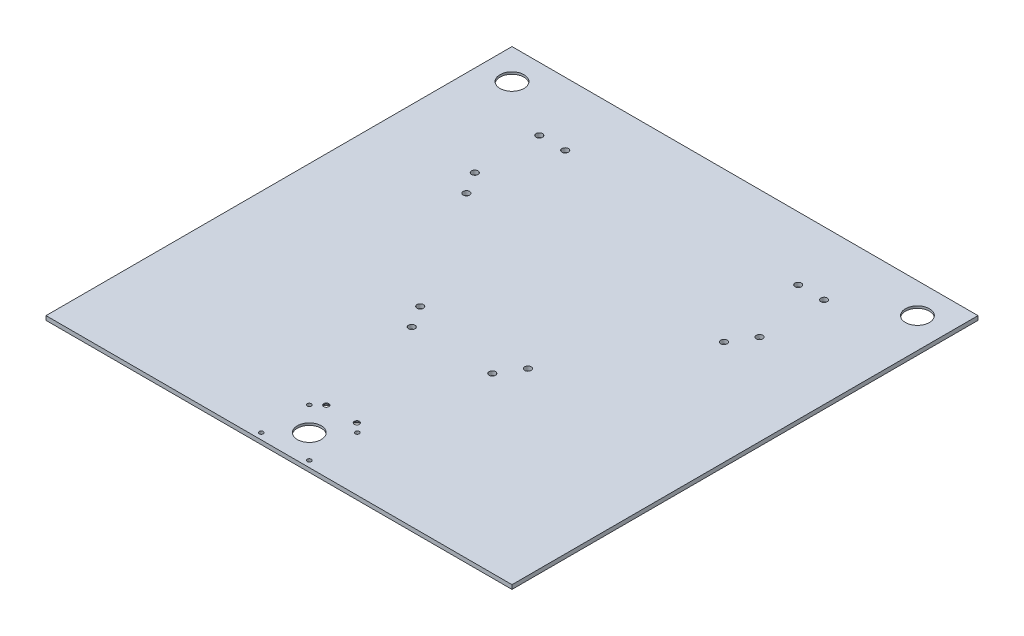
ISO-10303-21;
HEADER;
FILE_DESCRIPTION(('STEP AP214'),'2;1');
FILE_NAME('part.step','',(''),(''),'','','');
FILE_SCHEMA(('AUTOMOTIVE_DESIGN { 1 0 10303 214 1 1 1 1 }'));
ENDSEC;
DATA;
#1=APPLICATION_CONTEXT('core data for automotive mechanical design processes');
#2=APPLICATION_PROTOCOL_DEFINITION('international standard','automotive_design',2000,#1);
#3=PRODUCT_CONTEXT('',#1,'mechanical');
#4=PRODUCT('Part','Part','',(#3));
#5=PRODUCT_RELATED_PRODUCT_CATEGORY('part','',(#4));
#6=PRODUCT_DEFINITION_FORMATION('','',#4);
#7=PRODUCT_DEFINITION_CONTEXT('part definition',#1,'design');
#8=PRODUCT_DEFINITION('design','',#6,#7);
#9=PRODUCT_DEFINITION_SHAPE('','',#8);
#10=(LENGTH_UNIT() NAMED_UNIT(*) SI_UNIT(.MILLI.,.METRE.));
#11=(NAMED_UNIT(*) PLANE_ANGLE_UNIT() SI_UNIT($,.RADIAN.));
#12=(NAMED_UNIT(*) SI_UNIT($,.STERADIAN.) SOLID_ANGLE_UNIT());
#13=UNCERTAINTY_MEASURE_WITH_UNIT(LENGTH_MEASURE(1.E-05),#10,'distance_accuracy_value','');
#14=(GEOMETRIC_REPRESENTATION_CONTEXT(3) GLOBAL_UNCERTAINTY_ASSIGNED_CONTEXT((#13)) GLOBAL_UNIT_ASSIGNED_CONTEXT((#10,
#11,#12)) REPRESENTATION_CONTEXT('',''));
#15=CARTESIAN_POINT('',(0.,0.,0.));
#16=DIRECTION('',(0.,0.,1.));
#17=DIRECTION('',(1.,0.,0.));
#18=AXIS2_PLACEMENT_3D('',#15,#16,#17);
#19=CARTESIAN_POINT('',(228.6,4.064,228.6));
#20=DIRECTION('',(-1.,0.,0.));
#21=DIRECTION('',(0.,0.,1.));
#22=AXIS2_PLACEMENT_3D('',#19,#20,#21);
#23=PLANE('',#22);
#24=DIRECTION('',(0.,0.,-1.));
#25=VECTOR('',#24,1.);
#26=CARTESIAN_POINT('',(228.6,0.,228.6));
#27=LINE('',#26,#25);
#28=CARTESIAN_POINT('',(228.6,0.,228.6));
#29=VERTEX_POINT('',#28);
#30=CARTESIAN_POINT('',(228.6,0.,-228.6));
#31=VERTEX_POINT('',#30);
#32=EDGE_CURVE('E97',#29,#31,#27,.T.);
#33=ORIENTED_EDGE('',*,*,#32,.T.);
#34=DIRECTION('',(0.,-1.,0.));
#35=VECTOR('',#34,1.);
#36=CARTESIAN_POINT('',(228.6,4.064,-228.6));
#37=LINE('',#36,#35);
#38=CARTESIAN_POINT('',(228.6,4.064,-228.6));
#39=VERTEX_POINT('',#38);
#40=EDGE_CURVE('E11',#39,#31,#37,.T.);
#41=ORIENTED_EDGE('',*,*,#40,.F.);
#42=DIRECTION('',(0.,0.,-1.));
#43=VECTOR('',#42,1.);
#44=CARTESIAN_POINT('',(228.6,4.064,228.6));
#45=LINE('',#44,#43);
#46=CARTESIAN_POINT('',(228.6,4.064,228.6));
#47=VERTEX_POINT('',#46);
#48=EDGE_CURVE('E85',#47,#39,#45,.T.);
#49=ORIENTED_EDGE('',*,*,#48,.F.);
#50=DIRECTION('',(0.,-1.,0.));
#51=VECTOR('',#50,1.);
#52=CARTESIAN_POINT('',(228.6,4.064,228.6));
#53=LINE('',#52,#51);
#54=EDGE_CURVE('E93',#47,#29,#53,.T.);
#55=ORIENTED_EDGE('',*,*,#54,.T.);
#56=EDGE_LOOP('',(#33,#41,#49,#55));
#57=FACE_BOUND('',#56,.T.);
#58=ADVANCED_FACE('F34',(#57),#23,.F.);
#59=CARTESIAN_POINT('',(-228.6,4.064,-228.6));
#60=DIRECTION('',(0.,0.,1.));
#61=DIRECTION('',(1.,0.,0.));
#62=AXIS2_PLACEMENT_3D('',#59,#60,#61);
#63=PLANE('',#62);
#64=DIRECTION('',(-1.,0.,0.));
#65=VECTOR('',#64,1.);
#66=CARTESIAN_POINT('',(-228.6,0.,-228.6));
#67=LINE('',#66,#65);
#68=CARTESIAN_POINT('',(-228.6,0.,-228.6));
#69=VERTEX_POINT('',#68);
#70=EDGE_CURVE('E89',#31,#69,#67,.T.);
#71=ORIENTED_EDGE('',*,*,#70,.T.);
#72=DIRECTION('',(0.,-1.,0.));
#73=VECTOR('',#72,1.);
#74=CARTESIAN_POINT('',(-228.6,4.064,-228.6));
#75=LINE('',#74,#73);
#76=CARTESIAN_POINT('',(-228.6,4.064,-228.6));
#77=VERTEX_POINT('',#76);
#78=EDGE_CURVE('E42',#77,#69,#75,.T.);
#79=ORIENTED_EDGE('',*,*,#78,.F.);
#80=DIRECTION('',(-1.,0.,0.));
#81=VECTOR('',#80,1.);
#82=CARTESIAN_POINT('',(-228.6,4.064,-228.6));
#83=LINE('',#82,#81);
#84=EDGE_CURVE('E80',#39,#77,#83,.T.);
#85=ORIENTED_EDGE('',*,*,#84,.F.);
#86=ORIENTED_EDGE('',*,*,#40,.T.);
#87=EDGE_LOOP('',(#71,#79,#85,#86));
#88=FACE_BOUND('',#87,.T.);
#89=ADVANCED_FACE('F88',(#88),#63,.F.);
#90=CARTESIAN_POINT('',(-228.6,4.064,228.6));
#91=DIRECTION('',(1.,0.,0.));
#92=DIRECTION('',(0.,0.,-1.));
#93=AXIS2_PLACEMENT_3D('',#90,#91,#92);
#94=PLANE('',#93);
#95=DIRECTION('',(0.,0.,1.));
#96=VECTOR('',#95,1.);
#97=CARTESIAN_POINT('',(-228.6,0.,228.6));
#98=LINE('',#97,#96);
#99=CARTESIAN_POINT('',(-228.6,0.,228.6));
#100=VERTEX_POINT('',#99);
#101=EDGE_CURVE('E67',#69,#100,#98,.T.);
#102=ORIENTED_EDGE('',*,*,#101,.T.);
#103=DIRECTION('',(0.,-1.,0.));
#104=VECTOR('',#103,1.);
#105=CARTESIAN_POINT('',(-228.6,4.064,228.6));
#106=LINE('',#105,#104);
#107=CARTESIAN_POINT('',(-228.6,4.064,228.6));
#108=VERTEX_POINT('',#107);
#109=EDGE_CURVE('E90',#108,#100,#106,.T.);
#110=ORIENTED_EDGE('',*,*,#109,.F.);
#111=DIRECTION('',(0.,0.,1.));
#112=VECTOR('',#111,1.);
#113=CARTESIAN_POINT('',(-228.6,4.064,228.6));
#114=LINE('',#113,#112);
#115=EDGE_CURVE('E83',#77,#108,#114,.T.);
#116=ORIENTED_EDGE('',*,*,#115,.F.);
#117=ORIENTED_EDGE('',*,*,#78,.T.);
#118=EDGE_LOOP('',(#102,#110,#116,#117));
#119=FACE_BOUND('',#118,.T.);
#120=ADVANCED_FACE('F91',(#119),#94,.F.);
#121=CARTESIAN_POINT('',(-228.6,4.064,228.6));
#122=DIRECTION('',(0.,0.,-1.));
#123=DIRECTION('',(-1.,0.,0.));
#124=AXIS2_PLACEMENT_3D('',#121,#122,#123);
#125=PLANE('',#124);
#126=DIRECTION('',(1.,0.,0.));
#127=VECTOR('',#126,1.);
#128=CARTESIAN_POINT('',(-228.6,0.,228.6));
#129=LINE('',#128,#127);
#130=EDGE_CURVE('E73',#100,#29,#129,.T.);
#131=ORIENTED_EDGE('',*,*,#130,.T.);
#132=ORIENTED_EDGE('',*,*,#54,.F.);
#133=DIRECTION('',(1.,0.,0.));
#134=VECTOR('',#133,1.);
#135=CARTESIAN_POINT('',(-228.6,4.064,228.6));
#136=LINE('',#135,#134);
#137=EDGE_CURVE('E50',#108,#47,#136,.T.);
#138=ORIENTED_EDGE('',*,*,#137,.F.);
#139=ORIENTED_EDGE('',*,*,#109,.T.);
#140=EDGE_LOOP('',(#131,#132,#138,#139));
#141=FACE_BOUND('',#140,.T.);
#142=ADVANCED_FACE('F105',(#141),#125,.F.);
#143=CARTESIAN_POINT('',(0.,4.064,0.));
#144=DIRECTION('',(0.,-1.,0.));
#145=DIRECTION('',(0.,0.,-1.));
#146=AXIS2_PLACEMENT_3D('',#143,#144,#145);
#147=PLANE('',#146);
#148=CARTESIAN_POINT('',(39.4955397352569,4.064,58.8233112326497));
#149=DIRECTION('',(0.,-1.,0.));
#150=DIRECTION('',(0.,0.,-1.));
#151=AXIS2_PLACEMENT_3D('',#148,#149,#150);
#152=CIRCLE('',#151,3.175);
#153=CARTESIAN_POINT('',(39.4955397352569,4.064,55.6483112326497));
#154=VERTEX_POINT('',#153);
#155=EDGE_CURVE('E260',#154,#154,#152,.T.);
#156=ORIENTED_EDGE('',*,*,#155,.T.);
#157=EDGE_LOOP('',(#156));
#158=FACE_BOUND('',#157,.T.);
#159=CARTESIAN_POINT('',(52.8561344372227,4.064,37.2211236302377));
#160=DIRECTION('',(0.,-1.,0.));
#161=DIRECTION('',(0.,0.,-1.));
#162=AXIS2_PLACEMENT_3D('',#159,#160,#161);
#163=CIRCLE('',#162,3.175);
#164=CARTESIAN_POINT('',(52.8561344372227,4.064,34.0461236302377));
#165=VERTEX_POINT('',#164);
#166=EDGE_CURVE('E254',#165,#165,#163,.T.);
#167=ORIENTED_EDGE('',*,*,#166,.T.);
#168=EDGE_LOOP('',(#167));
#169=FACE_BOUND('',#168,.T.);
#170=CARTESIAN_POINT('',(126.339405298034,4.064,-81.5909081830286));
#171=DIRECTION('',(0.,-1.,0.));
#172=DIRECTION('',(0.,0.,-1.));
#173=AXIS2_PLACEMENT_3D('',#170,#171,#172);
#174=CIRCLE('',#173,3.17500000000001);
#175=CARTESIAN_POINT('',(126.339405298034,4.064,-84.7659081830286));
#176=VERTEX_POINT('',#175);
#177=EDGE_CURVE('E248',#176,#176,#174,.T.);
#178=ORIENTED_EDGE('',*,*,#177,.T.);
#179=EDGE_LOOP('',(#178));
#180=FACE_BOUND('',#179,.T.);
#181=CARTESIAN_POINT('',(139.7,4.064,-103.193095785441));
#182=DIRECTION('',(0.,-1.,0.));
#183=DIRECTION('',(0.,0.,-1.));
#184=AXIS2_PLACEMENT_3D('',#181,#182,#183);
#185=CIRCLE('',#184,3.17500000000001);
#186=CARTESIAN_POINT('',(139.7,4.064,-106.368095785441));
#187=VERTEX_POINT('',#186);
#188=EDGE_CURVE('E242',#187,#187,#185,.T.);
#189=ORIENTED_EDGE('',*,*,#188,.T.);
#190=EDGE_LOOP('',(#189));
#191=FACE_BOUND('',#190,.T.);
#192=CARTESIAN_POINT('',(139.7,4.064,-166.478718596382));
#193=DIRECTION('',(0.,-1.,0.));
#194=DIRECTION('',(0.,0.,-1.));
#195=AXIS2_PLACEMENT_3D('',#192,#193,#194);
#196=CIRCLE('',#195,3.17500000000001);
#197=CARTESIAN_POINT('',(139.7,4.064,-169.653718596382));
#198=VERTEX_POINT('',#197);
#199=EDGE_CURVE('E236',#198,#198,#196,.T.);
#200=ORIENTED_EDGE('',*,*,#199,.T.);
#201=EDGE_LOOP('',(#200));
#202=FACE_BOUND('',#201,.T.);
#203=CARTESIAN_POINT('',(114.3,4.064,-166.478718596382));
#204=DIRECTION('',(0.,-1.,0.));
#205=DIRECTION('',(0.,0.,-1.));
#206=AXIS2_PLACEMENT_3D('',#203,#204,#205);
#207=CIRCLE('',#206,3.175);
#208=CARTESIAN_POINT('',(114.3,4.064,-169.653718596382));
#209=VERTEX_POINT('',#208);
#210=EDGE_CURVE('E230',#209,#209,#207,.T.);
#211=ORIENTED_EDGE('',*,*,#210,.T.);
#212=EDGE_LOOP('',(#211));
#213=FACE_BOUND('',#212,.T.);
#214=CARTESIAN_POINT('',(-114.3,4.064,-166.478718596382));
#215=DIRECTION('',(0.,-1.,0.));
#216=DIRECTION('',(0.,0.,-1.));
#217=AXIS2_PLACEMENT_3D('',#214,#215,#216);
#218=CIRCLE('',#217,3.175);
#219=CARTESIAN_POINT('',(-114.3,4.064,-169.653718596382));
#220=VERTEX_POINT('',#219);
#221=EDGE_CURVE('E224',#220,#220,#218,.T.);
#222=ORIENTED_EDGE('',*,*,#221,.T.);
#223=EDGE_LOOP('',(#222));
#224=FACE_BOUND('',#223,.T.);
#225=CARTESIAN_POINT('',(-139.7,4.064,-166.478718596382));
#226=DIRECTION('',(0.,-1.,0.));
#227=DIRECTION('',(0.,0.,-1.));
#228=AXIS2_PLACEMENT_3D('',#225,#226,#227);
#229=CIRCLE('',#228,3.17500000000001);
#230=CARTESIAN_POINT('',(-139.7,4.064,-169.653718596382));
#231=VERTEX_POINT('',#230);
#232=EDGE_CURVE('E218',#231,#231,#229,.T.);
#233=ORIENTED_EDGE('',*,*,#232,.T.);
#234=EDGE_LOOP('',(#233));
#235=FACE_BOUND('',#234,.T.);
#236=CARTESIAN_POINT('',(-139.7,4.064,-103.193095785441));
#237=DIRECTION('',(0.,-1.,0.));
#238=DIRECTION('',(0.,0.,-1.));
#239=AXIS2_PLACEMENT_3D('',#236,#237,#238);
#240=CIRCLE('',#239,3.17500000000001);
#241=CARTESIAN_POINT('',(-139.7,4.064,-106.368095785441));
#242=VERTEX_POINT('',#241);
#243=EDGE_CURVE('E212',#242,#242,#240,.T.);
#244=ORIENTED_EDGE('',*,*,#243,.T.);
#245=EDGE_LOOP('',(#244));
#246=FACE_BOUND('',#245,.T.);
#247=CARTESIAN_POINT('',(-126.339405298034,4.064,-81.5909081830286));
#248=DIRECTION('',(0.,-1.,0.));
#249=DIRECTION('',(0.,0.,-1.));
#250=AXIS2_PLACEMENT_3D('',#247,#248,#249);
#251=CIRCLE('',#250,3.175);
#252=CARTESIAN_POINT('',(-126.339405298034,4.064,-84.7659081830286));
#253=VERTEX_POINT('',#252);
#254=EDGE_CURVE('E206',#253,#253,#251,.T.);
#255=ORIENTED_EDGE('',*,*,#254,.T.);
#256=EDGE_LOOP('',(#255));
#257=FACE_BOUND('',#256,.T.);
#258=CARTESIAN_POINT('',(-52.8561344372227,4.064,37.2211236302377));
#259=DIRECTION('',(0.,-1.,0.));
#260=DIRECTION('',(0.,0.,-1.));
#261=AXIS2_PLACEMENT_3D('',#258,#259,#260);
#262=CIRCLE('',#261,3.175);
#263=CARTESIAN_POINT('',(-52.8561344372227,4.064,34.0461236302377));
#264=VERTEX_POINT('',#263);
#265=EDGE_CURVE('E200',#264,#264,#262,.T.);
#266=ORIENTED_EDGE('',*,*,#265,.T.);
#267=EDGE_LOOP('',(#266));
#268=FACE_BOUND('',#267,.T.);
#269=CARTESIAN_POINT('',(-39.4955397352569,4.064,58.8233112326497));
#270=DIRECTION('',(0.,-1.,0.));
#271=DIRECTION('',(0.,0.,-1.));
#272=AXIS2_PLACEMENT_3D('',#269,#270,#271);
#273=CIRCLE('',#272,3.175);
#274=CARTESIAN_POINT('',(-39.4955397352569,4.064,55.6483112326497));
#275=VERTEX_POINT('',#274);
#276=EDGE_CURVE('E194',#275,#275,#273,.T.);
#277=ORIENTED_EDGE('',*,*,#276,.T.);
#278=EDGE_LOOP('',(#277));
#279=FACE_BOUND('',#278,.T.);
#280=CARTESIAN_POINT('',(-15.,4.064,167.174500066));
#281=DIRECTION('',(0.,-1.,0.));
#282=DIRECTION('',(0.,0.,-1.));
#283=AXIS2_PLACEMENT_3D('',#280,#281,#282);
#284=CIRCLE('',#283,2.5527);
#285=CARTESIAN_POINT('',(-15.,4.064,164.621800066));
#286=VERTEX_POINT('',#285);
#287=EDGE_CURVE('E182',#286,#286,#284,.T.);
#288=ORIENTED_EDGE('',*,*,#287,.T.);
#289=EDGE_LOOP('',(#288));
#290=FACE_BOUND('',#289,.T.);
#291=CARTESIAN_POINT('',(15.,4.064,167.174500066));
#292=DIRECTION('',(0.,-1.,0.));
#293=DIRECTION('',(0.,0.,-1.));
#294=AXIS2_PLACEMENT_3D('',#291,#292,#293);
#295=CIRCLE('',#294,2.5527);
#296=CARTESIAN_POINT('',(15.,4.064,164.621800066));
#297=VERTEX_POINT('',#296);
#298=EDGE_CURVE('E170',#297,#297,#295,.T.);
#299=ORIENTED_EDGE('',*,*,#298,.T.);
#300=EDGE_LOOP('',(#299));
#301=FACE_BOUND('',#300,.T.);
#302=CARTESIAN_POINT('',(-23.5731723178065,4.064,175.308827682194));
#303=DIRECTION('',(0.,-1.,0.));
#304=DIRECTION('',(0.,0.,-1.));
#305=AXIS2_PLACEMENT_3D('',#302,#303,#304);
#306=CIRCLE('',#305,2.0193);
#307=CARTESIAN_POINT('',(-23.5731723178065,4.064,173.289527682193));
#308=VERTEX_POINT('',#307);
#309=EDGE_CURVE('E164',#308,#308,#306,.T.);
#310=ORIENTED_EDGE('',*,*,#309,.T.);
#311=EDGE_LOOP('',(#310));
#312=FACE_BOUND('',#311,.T.);
#313=CARTESIAN_POINT('',(23.5731723178068,4.064,175.308827682193));
#314=DIRECTION('',(0.,-1.,0.));
#315=DIRECTION('',(0.,0.,-1.));
#316=AXIS2_PLACEMENT_3D('',#313,#314,#315);
#317=CIRCLE('',#316,2.0193);
#318=CARTESIAN_POINT('',(23.5731723178068,4.064,173.289527682193));
#319=VERTEX_POINT('',#318);
#320=EDGE_CURVE('E158',#319,#319,#317,.T.);
#321=ORIENTED_EDGE('',*,*,#320,.T.);
#322=EDGE_LOOP('',(#321));
#323=FACE_BOUND('',#322,.T.);
#324=CARTESIAN_POINT('',(-23.5731723178066,4.064,222.455172317807));
#325=DIRECTION('',(0.,-1.,0.));
#326=DIRECTION('',(0.,0.,-1.));
#327=AXIS2_PLACEMENT_3D('',#324,#325,#326);
#328=CIRCLE('',#327,2.0193);
#329=CARTESIAN_POINT('',(-23.5731723178066,4.064,220.435872317807));
#330=VERTEX_POINT('',#329);
#331=EDGE_CURVE('E152',#330,#330,#328,.T.);
#332=ORIENTED_EDGE('',*,*,#331,.T.);
#333=EDGE_LOOP('',(#332));
#334=FACE_BOUND('',#333,.T.);
#335=CARTESIAN_POINT('',(23.5731723178065,4.064,222.455172317807));
#336=DIRECTION('',(0.,-1.,0.));
#337=DIRECTION('',(0.,0.,-1.));
#338=AXIS2_PLACEMENT_3D('',#335,#336,#337);
#339=CIRCLE('',#338,2.0193);
#340=CARTESIAN_POINT('',(23.5731723178065,4.064,220.435872317807));
#341=VERTEX_POINT('',#340);
#342=EDGE_CURVE('E142',#341,#341,#339,.T.);
#343=ORIENTED_EDGE('',*,*,#342,.T.);
#344=EDGE_LOOP('',(#343));
#345=FACE_BOUND('',#344,.T.);
#346=CARTESIAN_POINT('',(-198.882,4.064,-198.882));
#347=DIRECTION('',(0.,-1.,0.));
#348=DIRECTION('',(0.,0.,-1.));
#349=AXIS2_PLACEMENT_3D('',#346,#347,#348);
#350=CIRCLE('',#349,11.7475);
#351=CARTESIAN_POINT('',(-198.882,4.064,-210.6295));
#352=VERTEX_POINT('',#351);
#353=EDGE_CURVE('E134',#352,#352,#350,.F.);
#354=ORIENTED_EDGE('',*,*,#353,.F.);
#355=EDGE_LOOP('',(#354));
#356=FACE_BOUND('',#355,.T.);
#357=CARTESIAN_POINT('',(198.882,4.064,-198.882));
#358=DIRECTION('',(0.,-1.,0.));
#359=DIRECTION('',(0.,0.,-1.));
#360=AXIS2_PLACEMENT_3D('',#357,#358,#359);
#361=CIRCLE('',#360,11.7475);
#362=CARTESIAN_POINT('',(198.882,4.064,-210.6295));
#363=VERTEX_POINT('',#362);
#364=EDGE_CURVE('E135',#363,#363,#361,.F.);
#365=ORIENTED_EDGE('',*,*,#364,.F.);
#366=EDGE_LOOP('',(#365));
#367=FACE_BOUND('',#366,.T.);
#368=CARTESIAN_POINT('',(0.,4.064,198.882));
#369=DIRECTION('',(0.,-1.,0.));
#370=DIRECTION('',(0.,0.,-1.));
#371=AXIS2_PLACEMENT_3D('',#368,#369,#370);
#372=CIRCLE('',#371,11.7475);
#373=CARTESIAN_POINT('',(0.,4.064,187.1345));
#374=VERTEX_POINT('',#373);
#375=EDGE_CURVE('E121',#374,#374,#372,.F.);
#376=ORIENTED_EDGE('',*,*,#375,.F.);
#377=EDGE_LOOP('',(#376));
#378=FACE_BOUND('',#377,.T.);
#379=ORIENTED_EDGE('',*,*,#48,.T.);
#380=ORIENTED_EDGE('',*,*,#84,.T.);
#381=ORIENTED_EDGE('',*,*,#115,.T.);
#382=ORIENTED_EDGE('',*,*,#137,.T.);
#383=EDGE_LOOP('',(#379,#380,#381,#382));
#384=FACE_BOUND('',#383,.T.);
#385=ADVANCED_FACE('F81',(#158,#169,#180,#191,#202,#213,#224,#235,#246,#257,#268,#279,#290,#301,
#312,#323,#334,#345,#356,#367,#378,#384),#147,.F.);
#386=CARTESIAN_POINT('',(0.,0.,0.));
#387=DIRECTION('',(0.,-1.,0.));
#388=DIRECTION('',(0.,0.,-1.));
#389=AXIS2_PLACEMENT_3D('',#386,#387,#388);
#390=PLANE('',#389);
#391=CARTESIAN_POINT('',(39.4955397352569,0.,58.8233112326497));
#392=DIRECTION('',(0.,-1.,0.));
#393=DIRECTION('',(0.,0.,-1.));
#394=AXIS2_PLACEMENT_3D('',#391,#392,#393);
#395=CIRCLE('',#394,3.175);
#396=CARTESIAN_POINT('',(39.4955397352569,0.,55.6483112326497));
#397=VERTEX_POINT('',#396);
#398=EDGE_CURVE('E263',#397,#397,#395,.T.);
#399=ORIENTED_EDGE('',*,*,#398,.F.);
#400=EDGE_LOOP('',(#399));
#401=FACE_BOUND('',#400,.T.);
#402=CARTESIAN_POINT('',(52.8561344372227,0.,37.2211236302377));
#403=DIRECTION('',(0.,-1.,0.));
#404=DIRECTION('',(0.,0.,-1.));
#405=AXIS2_PLACEMENT_3D('',#402,#403,#404);
#406=CIRCLE('',#405,3.175);
#407=CARTESIAN_POINT('',(52.8561344372227,0.,34.0461236302377));
#408=VERTEX_POINT('',#407);
#409=EDGE_CURVE('E257',#408,#408,#406,.T.);
#410=ORIENTED_EDGE('',*,*,#409,.F.);
#411=EDGE_LOOP('',(#410));
#412=FACE_BOUND('',#411,.T.);
#413=CARTESIAN_POINT('',(126.339405298034,0.,-81.5909081830286));
#414=DIRECTION('',(0.,-1.,0.));
#415=DIRECTION('',(0.,0.,-1.));
#416=AXIS2_PLACEMENT_3D('',#413,#414,#415);
#417=CIRCLE('',#416,3.17500000000001);
#418=CARTESIAN_POINT('',(126.339405298034,0.,-84.7659081830286));
#419=VERTEX_POINT('',#418);
#420=EDGE_CURVE('E251',#419,#419,#417,.T.);
#421=ORIENTED_EDGE('',*,*,#420,.F.);
#422=EDGE_LOOP('',(#421));
#423=FACE_BOUND('',#422,.T.);
#424=CARTESIAN_POINT('',(139.7,0.,-103.193095785441));
#425=DIRECTION('',(0.,-1.,0.));
#426=DIRECTION('',(0.,0.,-1.));
#427=AXIS2_PLACEMENT_3D('',#424,#425,#426);
#428=CIRCLE('',#427,3.17500000000001);
#429=CARTESIAN_POINT('',(139.7,0.,-106.368095785441));
#430=VERTEX_POINT('',#429);
#431=EDGE_CURVE('E245',#430,#430,#428,.T.);
#432=ORIENTED_EDGE('',*,*,#431,.F.);
#433=EDGE_LOOP('',(#432));
#434=FACE_BOUND('',#433,.T.);
#435=CARTESIAN_POINT('',(139.7,0.,-166.478718596382));
#436=DIRECTION('',(0.,-1.,0.));
#437=DIRECTION('',(0.,0.,-1.));
#438=AXIS2_PLACEMENT_3D('',#435,#436,#437);
#439=CIRCLE('',#438,3.17500000000001);
#440=CARTESIAN_POINT('',(139.7,0.,-169.653718596382));
#441=VERTEX_POINT('',#440);
#442=EDGE_CURVE('E239',#441,#441,#439,.T.);
#443=ORIENTED_EDGE('',*,*,#442,.F.);
#444=EDGE_LOOP('',(#443));
#445=FACE_BOUND('',#444,.T.);
#446=CARTESIAN_POINT('',(114.3,0.,-166.478718596382));
#447=DIRECTION('',(0.,-1.,0.));
#448=DIRECTION('',(0.,0.,-1.));
#449=AXIS2_PLACEMENT_3D('',#446,#447,#448);
#450=CIRCLE('',#449,3.175);
#451=CARTESIAN_POINT('',(114.3,0.,-169.653718596382));
#452=VERTEX_POINT('',#451);
#453=EDGE_CURVE('E233',#452,#452,#450,.T.);
#454=ORIENTED_EDGE('',*,*,#453,.F.);
#455=EDGE_LOOP('',(#454));
#456=FACE_BOUND('',#455,.T.);
#457=CARTESIAN_POINT('',(-114.3,0.,-166.478718596382));
#458=DIRECTION('',(0.,-1.,0.));
#459=DIRECTION('',(0.,0.,-1.));
#460=AXIS2_PLACEMENT_3D('',#457,#458,#459);
#461=CIRCLE('',#460,3.175);
#462=CARTESIAN_POINT('',(-114.3,0.,-169.653718596382));
#463=VERTEX_POINT('',#462);
#464=EDGE_CURVE('E227',#463,#463,#461,.T.);
#465=ORIENTED_EDGE('',*,*,#464,.F.);
#466=EDGE_LOOP('',(#465));
#467=FACE_BOUND('',#466,.T.);
#468=CARTESIAN_POINT('',(-139.7,0.,-166.478718596382));
#469=DIRECTION('',(0.,-1.,0.));
#470=DIRECTION('',(0.,0.,-1.));
#471=AXIS2_PLACEMENT_3D('',#468,#469,#470);
#472=CIRCLE('',#471,3.17500000000001);
#473=CARTESIAN_POINT('',(-139.7,0.,-169.653718596382));
#474=VERTEX_POINT('',#473);
#475=EDGE_CURVE('E221',#474,#474,#472,.T.);
#476=ORIENTED_EDGE('',*,*,#475,.F.);
#477=EDGE_LOOP('',(#476));
#478=FACE_BOUND('',#477,.T.);
#479=CARTESIAN_POINT('',(-139.7,0.,-103.193095785441));
#480=DIRECTION('',(0.,-1.,0.));
#481=DIRECTION('',(0.,0.,-1.));
#482=AXIS2_PLACEMENT_3D('',#479,#480,#481);
#483=CIRCLE('',#482,3.17500000000001);
#484=CARTESIAN_POINT('',(-139.7,0.,-106.368095785441));
#485=VERTEX_POINT('',#484);
#486=EDGE_CURVE('E215',#485,#485,#483,.T.);
#487=ORIENTED_EDGE('',*,*,#486,.F.);
#488=EDGE_LOOP('',(#487));
#489=FACE_BOUND('',#488,.T.);
#490=CARTESIAN_POINT('',(-126.339405298034,0.,-81.5909081830286));
#491=DIRECTION('',(0.,-1.,0.));
#492=DIRECTION('',(0.,0.,-1.));
#493=AXIS2_PLACEMENT_3D('',#490,#491,#492);
#494=CIRCLE('',#493,3.175);
#495=CARTESIAN_POINT('',(-126.339405298034,0.,-84.7659081830286));
#496=VERTEX_POINT('',#495);
#497=EDGE_CURVE('E209',#496,#496,#494,.T.);
#498=ORIENTED_EDGE('',*,*,#497,.F.);
#499=EDGE_LOOP('',(#498));
#500=FACE_BOUND('',#499,.T.);
#501=CARTESIAN_POINT('',(-52.8561344372227,0.,37.2211236302377));
#502=DIRECTION('',(0.,-1.,0.));
#503=DIRECTION('',(0.,0.,-1.));
#504=AXIS2_PLACEMENT_3D('',#501,#502,#503);
#505=CIRCLE('',#504,3.175);
#506=CARTESIAN_POINT('',(-52.8561344372227,0.,34.0461236302377));
#507=VERTEX_POINT('',#506);
#508=EDGE_CURVE('E203',#507,#507,#505,.T.);
#509=ORIENTED_EDGE('',*,*,#508,.F.);
#510=EDGE_LOOP('',(#509));
#511=FACE_BOUND('',#510,.T.);
#512=CARTESIAN_POINT('',(-39.4955397352569,0.,58.8233112326497));
#513=DIRECTION('',(0.,-1.,0.));
#514=DIRECTION('',(0.,0.,-1.));
#515=AXIS2_PLACEMENT_3D('',#512,#513,#514);
#516=CIRCLE('',#515,3.175);
#517=CARTESIAN_POINT('',(-39.4955397352569,0.,55.6483112326497));
#518=VERTEX_POINT('',#517);
#519=EDGE_CURVE('E197',#518,#518,#516,.T.);
#520=ORIENTED_EDGE('',*,*,#519,.F.);
#521=EDGE_LOOP('',(#520));
#522=FACE_BOUND('',#521,.T.);
#523=CARTESIAN_POINT('',(-15.,0.,167.174500066));
#524=DIRECTION('',(0.,-1.,0.));
#525=DIRECTION('',(0.,0.,-1.));
#526=AXIS2_PLACEMENT_3D('',#523,#524,#525);
#527=CIRCLE('',#526,5.55625);
#528=CARTESIAN_POINT('',(-15.,0.,161.618250066));
#529=VERTEX_POINT('',#528);
#530=EDGE_CURVE('E191',#529,#529,#527,.T.);
#531=ORIENTED_EDGE('',*,*,#530,.F.);
#532=EDGE_LOOP('',(#531));
#533=FACE_BOUND('',#532,.T.);
#534=CARTESIAN_POINT('',(15.,0.,167.174500066));
#535=DIRECTION('',(0.,-1.,0.));
#536=DIRECTION('',(0.,0.,-1.));
#537=AXIS2_PLACEMENT_3D('',#534,#535,#536);
#538=CIRCLE('',#537,5.55625);
#539=CARTESIAN_POINT('',(15.,0.,161.618250066));
#540=VERTEX_POINT('',#539);
#541=EDGE_CURVE('E179',#540,#540,#538,.T.);
#542=ORIENTED_EDGE('',*,*,#541,.F.);
#543=EDGE_LOOP('',(#542));
#544=FACE_BOUND('',#543,.T.);
#545=CARTESIAN_POINT('',(-23.5731723178065,0.,175.308827682194));
#546=DIRECTION('',(0.,-1.,0.));
#547=DIRECTION('',(0.,0.,-1.));
#548=AXIS2_PLACEMENT_3D('',#545,#546,#547);
#549=CIRCLE('',#548,2.0193);
#550=CARTESIAN_POINT('',(-23.5731723178065,0.,173.289527682193));
#551=VERTEX_POINT('',#550);
#552=EDGE_CURVE('E167',#551,#551,#549,.T.);
#553=ORIENTED_EDGE('',*,*,#552,.F.);
#554=EDGE_LOOP('',(#553));
#555=FACE_BOUND('',#554,.T.);
#556=CARTESIAN_POINT('',(23.5731723178068,0.,175.308827682193));
#557=DIRECTION('',(0.,-1.,0.));
#558=DIRECTION('',(0.,0.,-1.));
#559=AXIS2_PLACEMENT_3D('',#556,#557,#558);
#560=CIRCLE('',#559,2.0193);
#561=CARTESIAN_POINT('',(23.5731723178068,0.,173.289527682193));
#562=VERTEX_POINT('',#561);
#563=EDGE_CURVE('E161',#562,#562,#560,.T.);
#564=ORIENTED_EDGE('',*,*,#563,.F.);
#565=EDGE_LOOP('',(#564));
#566=FACE_BOUND('',#565,.T.);
#567=CARTESIAN_POINT('',(-23.5731723178066,0.,222.455172317807));
#568=DIRECTION('',(0.,-1.,0.));
#569=DIRECTION('',(0.,0.,-1.));
#570=AXIS2_PLACEMENT_3D('',#567,#568,#569);
#571=CIRCLE('',#570,2.0193);
#572=CARTESIAN_POINT('',(-23.5731723178066,0.,220.435872317807));
#573=VERTEX_POINT('',#572);
#574=EDGE_CURVE('E155',#573,#573,#571,.T.);
#575=ORIENTED_EDGE('',*,*,#574,.F.);
#576=EDGE_LOOP('',(#575));
#577=FACE_BOUND('',#576,.T.);
#578=CARTESIAN_POINT('',(23.5731723178065,0.,222.455172317807));
#579=DIRECTION('',(0.,-1.,0.));
#580=DIRECTION('',(0.,0.,-1.));
#581=AXIS2_PLACEMENT_3D('',#578,#579,#580);
#582=CIRCLE('',#581,2.0193);
#583=CARTESIAN_POINT('',(23.5731723178065,0.,220.435872317807));
#584=VERTEX_POINT('',#583);
#585=EDGE_CURVE('E149',#584,#584,#582,.T.);
#586=ORIENTED_EDGE('',*,*,#585,.F.);
#587=EDGE_LOOP('',(#586));
#588=FACE_BOUND('',#587,.T.);
#589=CARTESIAN_POINT('',(-198.882,0.,-198.882));
#590=DIRECTION('',(0.,-1.,0.));
#591=DIRECTION('',(0.,0.,-1.));
#592=AXIS2_PLACEMENT_3D('',#589,#590,#591);
#593=CIRCLE('',#592,19.177);
#594=CARTESIAN_POINT('',(-198.882,0.,-218.059));
#595=VERTEX_POINT('',#594);
#596=EDGE_CURVE('E124',#595,#595,#593,.T.);
#597=ORIENTED_EDGE('',*,*,#596,.F.);
#598=EDGE_LOOP('',(#597));
#599=FACE_BOUND('',#598,.T.);
#600=CARTESIAN_POINT('',(198.882,0.,-198.882));
#601=DIRECTION('',(0.,-1.,0.));
#602=DIRECTION('',(0.,0.,-1.));
#603=AXIS2_PLACEMENT_3D('',#600,#601,#602);
#604=CIRCLE('',#603,19.177);
#605=CARTESIAN_POINT('',(198.882,0.,-218.059));
#606=VERTEX_POINT('',#605);
#607=EDGE_CURVE('E117',#606,#606,#604,.T.);
#608=ORIENTED_EDGE('',*,*,#607,.F.);
#609=EDGE_LOOP('',(#608));
#610=FACE_BOUND('',#609,.T.);
#611=CARTESIAN_POINT('',(0.,0.,198.882));
#612=DIRECTION('',(0.,-1.,0.));
#613=DIRECTION('',(0.,0.,-1.));
#614=AXIS2_PLACEMENT_3D('',#611,#612,#613);
#615=CIRCLE('',#614,19.177);
#616=CARTESIAN_POINT('',(0.,0.,179.705));
#617=VERTEX_POINT('',#616);
#618=EDGE_CURVE('E111',#617,#617,#615,.T.);
#619=ORIENTED_EDGE('',*,*,#618,.F.);
#620=EDGE_LOOP('',(#619));
#621=FACE_BOUND('',#620,.T.);
#622=ORIENTED_EDGE('',*,*,#32,.F.);
#623=ORIENTED_EDGE('',*,*,#130,.F.);
#624=ORIENTED_EDGE('',*,*,#101,.F.);
#625=ORIENTED_EDGE('',*,*,#70,.F.);
#626=EDGE_LOOP('',(#622,#623,#624,#625));
#627=FACE_BOUND('',#626,.T.);
#628=ADVANCED_FACE('F108',(#401,#412,#423,#434,#445,#456,#467,#478,#489,#500,#511,#522,#533,
#544,#555,#566,#577,#588,#599,#610,#621,#627),#390,.T.);
#629=CARTESIAN_POINT('',(0.,1.905,198.882));
#630=DIRECTION('',(0.,-1.,0.));
#631=DIRECTION('',(0.,0.,-1.));
#632=AXIS2_PLACEMENT_3D('',#629,#630,#631);
#633=CYLINDRICAL_SURFACE('',#632,19.177);
#634=CARTESIAN_POINT('',(0.,1.905,198.882));
#635=DIRECTION('',(0.,-1.,0.));
#636=DIRECTION('',(0.,0.,-1.));
#637=AXIS2_PLACEMENT_3D('',#634,#635,#636);
#638=CIRCLE('',#637,19.177);
#639=CARTESIAN_POINT('',(0.,1.905,179.705));
#640=VERTEX_POINT('',#639);
#641=EDGE_CURVE('E100',#640,#640,#638,.T.);
#642=ORIENTED_EDGE('',*,*,#641,.F.);
#643=EDGE_LOOP('',(#642));
#644=FACE_BOUND('',#643,.T.);
#645=ORIENTED_EDGE('',*,*,#618,.T.);
#646=EDGE_LOOP('',(#645));
#647=FACE_BOUND('',#646,.T.);
#648=ADVANCED_FACE('F271',(#644,#647),#633,.F.);
#649=CARTESIAN_POINT('',(0.,1.905,198.882));
#650=DIRECTION('',(0.,-1.,0.));
#651=DIRECTION('',(0.,0.,-1.));
#652=AXIS2_PLACEMENT_3D('',#649,#650,#651);
#653=PLANE('',#652);
#654=CARTESIAN_POINT('',(0.,1.905,198.882));
#655=DIRECTION('',(0.,-1.,0.));
#656=DIRECTION('',(0.,0.,-1.));
#657=AXIS2_PLACEMENT_3D('',#654,#655,#656);
#658=CIRCLE('',#657,11.7475);
#659=CARTESIAN_POINT('',(0.,1.905,187.1345));
#660=VERTEX_POINT('',#659);
#661=EDGE_CURVE('E131',#660,#660,#658,.T.);
#662=ORIENTED_EDGE('',*,*,#661,.F.);
#663=EDGE_LOOP('',(#662));
#664=FACE_BOUND('',#663,.T.);
#665=ORIENTED_EDGE('',*,*,#641,.T.);
#666=EDGE_LOOP('',(#665));
#667=FACE_BOUND('',#666,.T.);
#668=ADVANCED_FACE('F314',(#664,#667),#653,.T.);
#669=CARTESIAN_POINT('',(198.882,1.905,-198.882));
#670=DIRECTION('',(0.,-1.,0.));
#671=DIRECTION('',(0.,0.,-1.));
#672=AXIS2_PLACEMENT_3D('',#669,#670,#671);
#673=CYLINDRICAL_SURFACE('',#672,19.177);
#674=CARTESIAN_POINT('',(198.882,1.905,-198.882));
#675=DIRECTION('',(0.,-1.,0.));
#676=DIRECTION('',(0.,0.,-1.));
#677=AXIS2_PLACEMENT_3D('',#674,#675,#676);
#678=CIRCLE('',#677,19.177);
#679=CARTESIAN_POINT('',(198.882,1.905,-218.059));
#680=VERTEX_POINT('',#679);
#681=EDGE_CURVE('E120',#680,#680,#678,.T.);
#682=ORIENTED_EDGE('',*,*,#681,.F.);
#683=EDGE_LOOP('',(#682));
#684=FACE_BOUND('',#683,.T.);
#685=ORIENTED_EDGE('',*,*,#607,.T.);
#686=EDGE_LOOP('',(#685));
#687=FACE_BOUND('',#686,.T.);
#688=ADVANCED_FACE('F321',(#684,#687),#673,.F.);
#689=CARTESIAN_POINT('',(198.882,1.905,-198.882));
#690=DIRECTION('',(0.,-1.,0.));
#691=DIRECTION('',(0.,0.,-1.));
#692=AXIS2_PLACEMENT_3D('',#689,#690,#691);
#693=PLANE('',#692);
#694=CARTESIAN_POINT('',(198.882,1.905,-198.882));
#695=DIRECTION('',(0.,-1.,0.));
#696=DIRECTION('',(0.,0.,-1.));
#697=AXIS2_PLACEMENT_3D('',#694,#695,#696);
#698=CIRCLE('',#697,11.7475);
#699=CARTESIAN_POINT('',(198.882,1.905,-210.6295));
#700=VERTEX_POINT('',#699);
#701=EDGE_CURVE('E139',#700,#700,#698,.T.);
#702=ORIENTED_EDGE('',*,*,#701,.F.);
#703=EDGE_LOOP('',(#702));
#704=FACE_BOUND('',#703,.T.);
#705=ORIENTED_EDGE('',*,*,#681,.T.);
#706=EDGE_LOOP('',(#705));
#707=FACE_BOUND('',#706,.T.);
#708=ADVANCED_FACE('F403',(#704,#707),#693,.T.);
#709=CARTESIAN_POINT('',(-198.882,1.905,-198.882));
#710=DIRECTION('',(0.,-1.,0.));
#711=DIRECTION('',(0.,0.,-1.));
#712=AXIS2_PLACEMENT_3D('',#709,#710,#711);
#713=CYLINDRICAL_SURFACE('',#712,19.177);
#714=CARTESIAN_POINT('',(-198.882,1.905,-198.882));
#715=DIRECTION('',(0.,-1.,0.));
#716=DIRECTION('',(0.,0.,-1.));
#717=AXIS2_PLACEMENT_3D('',#714,#715,#716);
#718=CIRCLE('',#717,19.177);
#719=CARTESIAN_POINT('',(-198.882,1.905,-218.059));
#720=VERTEX_POINT('',#719);
#721=EDGE_CURVE('E114',#720,#720,#718,.T.);
#722=ORIENTED_EDGE('',*,*,#721,.F.);
#723=EDGE_LOOP('',(#722));
#724=FACE_BOUND('',#723,.T.);
#725=ORIENTED_EDGE('',*,*,#596,.T.);
#726=EDGE_LOOP('',(#725));
#727=FACE_BOUND('',#726,.T.);
#728=ADVANCED_FACE('F396',(#724,#727),#713,.F.);
#729=CARTESIAN_POINT('',(-198.882,1.905,-198.882));
#730=DIRECTION('',(0.,-1.,0.));
#731=DIRECTION('',(0.,0.,-1.));
#732=AXIS2_PLACEMENT_3D('',#729,#730,#731);
#733=PLANE('',#732);
#734=CARTESIAN_POINT('',(-198.882,1.905,-198.882));
#735=DIRECTION('',(0.,-1.,0.));
#736=DIRECTION('',(0.,0.,-1.));
#737=AXIS2_PLACEMENT_3D('',#734,#735,#736);
#738=CIRCLE('',#737,11.7475);
#739=CARTESIAN_POINT('',(-198.882,1.905,-210.6295));
#740=VERTEX_POINT('',#739);
#741=EDGE_CURVE('E138',#740,#740,#738,.T.);
#742=ORIENTED_EDGE('',*,*,#741,.F.);
#743=EDGE_LOOP('',(#742));
#744=FACE_BOUND('',#743,.T.);
#745=ORIENTED_EDGE('',*,*,#721,.T.);
#746=EDGE_LOOP('',(#745));
#747=FACE_BOUND('',#746,.T.);
#748=ADVANCED_FACE('F386',(#744,#747),#733,.T.);
#749=CARTESIAN_POINT('',(0.,4.065,198.882));
#750=DIRECTION('',(0.,-1.,0.));
#751=DIRECTION('',(0.,0.,-1.));
#752=AXIS2_PLACEMENT_3D('',#749,#750,#751);
#753=CYLINDRICAL_SURFACE('',#752,11.7475);
#754=ORIENTED_EDGE('',*,*,#661,.T.);
#755=EDGE_LOOP('',(#754));
#756=FACE_BOUND('',#755,.T.);
#757=ORIENTED_EDGE('',*,*,#375,.T.);
#758=EDGE_LOOP('',(#757));
#759=FACE_BOUND('',#758,.T.);
#760=ADVANCED_FACE('F383',(#756,#759),#753,.F.);
#761=CARTESIAN_POINT('',(-198.882,4.065,-198.882));
#762=DIRECTION('',(0.,-1.,0.));
#763=DIRECTION('',(0.,0.,-1.));
#764=AXIS2_PLACEMENT_3D('',#761,#762,#763);
#765=CYLINDRICAL_SURFACE('',#764,11.7475);
#766=ORIENTED_EDGE('',*,*,#741,.T.);
#767=EDGE_LOOP('',(#766));
#768=FACE_BOUND('',#767,.T.);
#769=ORIENTED_EDGE('',*,*,#353,.T.);
#770=EDGE_LOOP('',(#769));
#771=FACE_BOUND('',#770,.T.);
#772=ADVANCED_FACE('F385',(#768,#771),#765,.F.);
#773=CARTESIAN_POINT('',(198.882,4.065,-198.882));
#774=DIRECTION('',(0.,-1.,0.));
#775=DIRECTION('',(0.,0.,-1.));
#776=AXIS2_PLACEMENT_3D('',#773,#774,#775);
#777=CYLINDRICAL_SURFACE('',#776,11.7475);
#778=ORIENTED_EDGE('',*,*,#701,.T.);
#779=EDGE_LOOP('',(#778));
#780=FACE_BOUND('',#779,.T.);
#781=ORIENTED_EDGE('',*,*,#364,.T.);
#782=EDGE_LOOP('',(#781));
#783=FACE_BOUND('',#782,.T.);
#784=ADVANCED_FACE('F393',(#780,#783),#777,.F.);
#785=CARTESIAN_POINT('',(23.5731723178065,0.,222.455172317807));
#786=DIRECTION('',(0.,-1.,0.));
#787=DIRECTION('',(0.,0.,-1.));
#788=AXIS2_PLACEMENT_3D('',#785,#786,#787);
#789=CYLINDRICAL_SURFACE('',#788,2.0193);
#790=ORIENTED_EDGE('',*,*,#342,.F.);
#791=EDGE_LOOP('',(#790));
#792=FACE_BOUND('',#791,.T.);
#793=ORIENTED_EDGE('',*,*,#585,.T.);
#794=EDGE_LOOP('',(#793));
#795=FACE_BOUND('',#794,.T.);
#796=ADVANCED_FACE('F448',(#792,#795),#789,.F.);
#797=CARTESIAN_POINT('',(-23.5731723178066,0.,222.455172317807));
#798=DIRECTION('',(0.,-1.,0.));
#799=DIRECTION('',(0.,0.,-1.));
#800=AXIS2_PLACEMENT_3D('',#797,#798,#799);
#801=CYLINDRICAL_SURFACE('',#800,2.0193);
#802=ORIENTED_EDGE('',*,*,#331,.F.);
#803=EDGE_LOOP('',(#802));
#804=FACE_BOUND('',#803,.T.);
#805=ORIENTED_EDGE('',*,*,#574,.T.);
#806=EDGE_LOOP('',(#805));
#807=FACE_BOUND('',#806,.T.);
#808=ADVANCED_FACE('F458',(#804,#807),#801,.F.);
#809=CARTESIAN_POINT('',(23.5731723178068,0.,175.308827682193));
#810=DIRECTION('',(0.,-1.,0.));
#811=DIRECTION('',(0.,0.,-1.));
#812=AXIS2_PLACEMENT_3D('',#809,#810,#811);
#813=CYLINDRICAL_SURFACE('',#812,2.0193);
#814=ORIENTED_EDGE('',*,*,#320,.F.);
#815=EDGE_LOOP('',(#814));
#816=FACE_BOUND('',#815,.T.);
#817=ORIENTED_EDGE('',*,*,#563,.T.);
#818=EDGE_LOOP('',(#817));
#819=FACE_BOUND('',#818,.T.);
#820=ADVANCED_FACE('F470',(#816,#819),#813,.F.);
#821=CARTESIAN_POINT('',(-23.5731723178065,0.,175.308827682194));
#822=DIRECTION('',(0.,-1.,0.));
#823=DIRECTION('',(0.,0.,-1.));
#824=AXIS2_PLACEMENT_3D('',#821,#822,#823);
#825=CYLINDRICAL_SURFACE('',#824,2.0193);
#826=ORIENTED_EDGE('',*,*,#309,.F.);
#827=EDGE_LOOP('',(#826));
#828=FACE_BOUND('',#827,.T.);
#829=ORIENTED_EDGE('',*,*,#552,.T.);
#830=EDGE_LOOP('',(#829));
#831=FACE_BOUND('',#830,.T.);
#832=ADVANCED_FACE('F481',(#828,#831),#825,.F.);
#833=CARTESIAN_POINT('',(15.,0.,167.174500066));
#834=DIRECTION('',(0.,-1.,0.));
#835=DIRECTION('',(0.,0.,-1.));
#836=AXIS2_PLACEMENT_3D('',#833,#834,#835);
#837=CYLINDRICAL_SURFACE('',#836,2.55270000000001);
#838=ORIENTED_EDGE('',*,*,#298,.F.);
#839=EDGE_LOOP('',(#838));
#840=FACE_BOUND('',#839,.T.);
#841=CARTESIAN_POINT('',(15.,3.1242,167.174500066));
#842=DIRECTION('',(0.,-1.,0.));
#843=DIRECTION('',(0.,0.,-1.));
#844=AXIS2_PLACEMENT_3D('',#841,#842,#843);
#845=CIRCLE('',#844,2.55270000000001);
#846=CARTESIAN_POINT('',(15.,3.1242,164.621800066));
#847=VERTEX_POINT('',#846);
#848=EDGE_CURVE('E173',#847,#847,#845,.T.);
#849=ORIENTED_EDGE('',*,*,#848,.T.);
#850=EDGE_LOOP('',(#849));
#851=FACE_BOUND('',#850,.T.);
#852=ADVANCED_FACE('F491',(#840,#851),#837,.F.);
#853=CARTESIAN_POINT('',(17.5527,3.1242,167.174500066));
#854=DIRECTION('',(0.,1.,0.));
#855=DIRECTION('',(0.,0.,1.));
#856=AXIS2_PLACEMENT_3D('',#853,#854,#855);
#857=PLANE('',#856);
#858=ORIENTED_EDGE('',*,*,#848,.F.);
#859=EDGE_LOOP('',(#858));
#860=FACE_BOUND('',#859,.T.);
#861=CARTESIAN_POINT('',(15.,3.1242,167.174500066));
#862=DIRECTION('',(0.,-1.,0.));
#863=DIRECTION('',(0.,0.,-1.));
#864=AXIS2_PLACEMENT_3D('',#861,#862,#863);
#865=CIRCLE('',#864,5.55625);
#866=CARTESIAN_POINT('',(15.,3.1242,161.618250066));
#867=VERTEX_POINT('',#866);
#868=EDGE_CURVE('E176',#867,#867,#865,.T.);
#869=ORIENTED_EDGE('',*,*,#868,.T.);
#870=EDGE_LOOP('',(#869));
#871=FACE_BOUND('',#870,.T.);
#872=ADVANCED_FACE('F501',(#860,#871),#857,.F.);
#873=CARTESIAN_POINT('',(15.,0.,167.174500066));
#874=DIRECTION('',(0.,-1.,0.));
#875=DIRECTION('',(0.,0.,-1.));
#876=AXIS2_PLACEMENT_3D('',#873,#874,#875);
#877=CYLINDRICAL_SURFACE('',#876,5.55625);
#878=ORIENTED_EDGE('',*,*,#868,.F.);
#879=EDGE_LOOP('',(#878));
#880=FACE_BOUND('',#879,.T.);
#881=ORIENTED_EDGE('',*,*,#541,.T.);
#882=EDGE_LOOP('',(#881));
#883=FACE_BOUND('',#882,.T.);
#884=ADVANCED_FACE('F511',(#880,#883),#877,.F.);
#885=CARTESIAN_POINT('',(-15.,0.,167.174500066));
#886=DIRECTION('',(0.,-1.,0.));
#887=DIRECTION('',(0.,0.,-1.));
#888=AXIS2_PLACEMENT_3D('',#885,#886,#887);
#889=CYLINDRICAL_SURFACE('',#888,2.55270000000001);
#890=ORIENTED_EDGE('',*,*,#287,.F.);
#891=EDGE_LOOP('',(#890));
#892=FACE_BOUND('',#891,.T.);
#893=CARTESIAN_POINT('',(-15.,3.1242,167.174500066));
#894=DIRECTION('',(0.,-1.,0.));
#895=DIRECTION('',(0.,0.,-1.));
#896=AXIS2_PLACEMENT_3D('',#893,#894,#895);
#897=CIRCLE('',#896,2.55270000000001);
#898=CARTESIAN_POINT('',(-15.,3.1242,164.621800066));
#899=VERTEX_POINT('',#898);
#900=EDGE_CURVE('E185',#899,#899,#897,.T.);
#901=ORIENTED_EDGE('',*,*,#900,.T.);
#902=EDGE_LOOP('',(#901));
#903=FACE_BOUND('',#902,.T.);
#904=ADVANCED_FACE('F521',(#892,#903),#889,.F.);
#905=CARTESIAN_POINT('',(-12.4473,3.1242,167.174500066));
#906=DIRECTION('',(0.,1.,0.));
#907=DIRECTION('',(0.,0.,1.));
#908=AXIS2_PLACEMENT_3D('',#905,#906,#907);
#909=PLANE('',#908);
#910=ORIENTED_EDGE('',*,*,#900,.F.);
#911=EDGE_LOOP('',(#910));
#912=FACE_BOUND('',#911,.T.);
#913=CARTESIAN_POINT('',(-15.,3.1242,167.174500066));
#914=DIRECTION('',(0.,-1.,0.));
#915=DIRECTION('',(0.,0.,-1.));
#916=AXIS2_PLACEMENT_3D('',#913,#914,#915);
#917=CIRCLE('',#916,5.55625);
#918=CARTESIAN_POINT('',(-15.,3.1242,161.618250066));
#919=VERTEX_POINT('',#918);
#920=EDGE_CURVE('E188',#919,#919,#917,.T.);
#921=ORIENTED_EDGE('',*,*,#920,.T.);
#922=EDGE_LOOP('',(#921));
#923=FACE_BOUND('',#922,.T.);
#924=ADVANCED_FACE('F531',(#912,#923),#909,.F.);
#925=CARTESIAN_POINT('',(-15.,0.,167.174500066));
#926=DIRECTION('',(0.,-1.,0.));
#927=DIRECTION('',(0.,0.,-1.));
#928=AXIS2_PLACEMENT_3D('',#925,#926,#927);
#929=CYLINDRICAL_SURFACE('',#928,5.55625);
#930=ORIENTED_EDGE('',*,*,#920,.F.);
#931=EDGE_LOOP('',(#930));
#932=FACE_BOUND('',#931,.T.);
#933=ORIENTED_EDGE('',*,*,#530,.T.);
#934=EDGE_LOOP('',(#933));
#935=FACE_BOUND('',#934,.T.);
#936=ADVANCED_FACE('F540',(#932,#935),#929,.F.);
#937=CARTESIAN_POINT('',(-39.4955397352569,0.,58.8233112326497));
#938=DIRECTION('',(0.,-1.,0.));
#939=DIRECTION('',(0.,0.,-1.));
#940=AXIS2_PLACEMENT_3D('',#937,#938,#939);
#941=CYLINDRICAL_SURFACE('',#940,3.175);
#942=ORIENTED_EDGE('',*,*,#276,.F.);
#943=EDGE_LOOP('',(#942));
#944=FACE_BOUND('',#943,.T.);
#945=ORIENTED_EDGE('',*,*,#519,.T.);
#946=EDGE_LOOP('',(#945));
#947=FACE_BOUND('',#946,.T.);
#948=ADVANCED_FACE('F549',(#944,#947),#941,.F.);
#949=CARTESIAN_POINT('',(-52.8561344372227,0.,37.2211236302377));
#950=DIRECTION('',(0.,-1.,0.));
#951=DIRECTION('',(0.,0.,-1.));
#952=AXIS2_PLACEMENT_3D('',#949,#950,#951);
#953=CYLINDRICAL_SURFACE('',#952,3.175);
#954=ORIENTED_EDGE('',*,*,#265,.F.);
#955=EDGE_LOOP('',(#954));
#956=FACE_BOUND('',#955,.T.);
#957=ORIENTED_EDGE('',*,*,#508,.T.);
#958=EDGE_LOOP('',(#957));
#959=FACE_BOUND('',#958,.T.);
#960=ADVANCED_FACE('F560',(#956,#959),#953,.F.);
#961=CARTESIAN_POINT('',(-126.339405298034,0.,-81.5909081830286));
#962=DIRECTION('',(0.,-1.,0.));
#963=DIRECTION('',(0.,0.,-1.));
#964=AXIS2_PLACEMENT_3D('',#961,#962,#963);
#965=CYLINDRICAL_SURFACE('',#964,3.175);
#966=ORIENTED_EDGE('',*,*,#254,.F.);
#967=EDGE_LOOP('',(#966));
#968=FACE_BOUND('',#967,.T.);
#969=ORIENTED_EDGE('',*,*,#497,.T.);
#970=EDGE_LOOP('',(#969));
#971=FACE_BOUND('',#970,.T.);
#972=ADVANCED_FACE('F567',(#968,#971),#965,.F.);
#973=CARTESIAN_POINT('',(-139.7,0.,-103.193095785441));
#974=DIRECTION('',(0.,-1.,0.));
#975=DIRECTION('',(0.,0.,-1.));
#976=AXIS2_PLACEMENT_3D('',#973,#974,#975);
#977=CYLINDRICAL_SURFACE('',#976,3.17500000000001);
#978=ORIENTED_EDGE('',*,*,#243,.F.);
#979=EDGE_LOOP('',(#978));
#980=FACE_BOUND('',#979,.T.);
#981=ORIENTED_EDGE('',*,*,#486,.T.);
#982=EDGE_LOOP('',(#981));
#983=FACE_BOUND('',#982,.T.);
#984=ADVANCED_FACE('F575',(#980,#983),#977,.F.);
#985=CARTESIAN_POINT('',(-139.7,0.,-166.478718596382));
#986=DIRECTION('',(0.,-1.,0.));
#987=DIRECTION('',(0.,0.,-1.));
#988=AXIS2_PLACEMENT_3D('',#985,#986,#987);
#989=CYLINDRICAL_SURFACE('',#988,3.17500000000001);
#990=ORIENTED_EDGE('',*,*,#232,.F.);
#991=EDGE_LOOP('',(#990));
#992=FACE_BOUND('',#991,.T.);
#993=ORIENTED_EDGE('',*,*,#475,.T.);
#994=EDGE_LOOP('',(#993));
#995=FACE_BOUND('',#994,.T.);
#996=ADVANCED_FACE('F583',(#992,#995),#989,.F.);
#997=CARTESIAN_POINT('',(-114.3,0.,-166.478718596382));
#998=DIRECTION('',(0.,-1.,0.));
#999=DIRECTION('',(0.,0.,-1.));
#1000=AXIS2_PLACEMENT_3D('',#997,#998,#999);
#1001=CYLINDRICAL_SURFACE('',#1000,3.175);
#1002=ORIENTED_EDGE('',*,*,#221,.F.);
#1003=EDGE_LOOP('',(#1002));
#1004=FACE_BOUND('',#1003,.T.);
#1005=ORIENTED_EDGE('',*,*,#464,.T.);
#1006=EDGE_LOOP('',(#1005));
#1007=FACE_BOUND('',#1006,.T.);
#1008=ADVANCED_FACE('F591',(#1004,#1007),#1001,.F.);
#1009=CARTESIAN_POINT('',(114.3,0.,-166.478718596382));
#1010=DIRECTION('',(0.,-1.,0.));
#1011=DIRECTION('',(0.,0.,-1.));
#1012=AXIS2_PLACEMENT_3D('',#1009,#1010,#1011);
#1013=CYLINDRICAL_SURFACE('',#1012,3.175);
#1014=ORIENTED_EDGE('',*,*,#210,.F.);
#1015=EDGE_LOOP('',(#1014));
#1016=FACE_BOUND('',#1015,.T.);
#1017=ORIENTED_EDGE('',*,*,#453,.T.);
#1018=EDGE_LOOP('',(#1017));
#1019=FACE_BOUND('',#1018,.T.);
#1020=ADVANCED_FACE('F599',(#1016,#1019),#1013,.F.);
#1021=CARTESIAN_POINT('',(139.7,0.,-166.478718596382));
#1022=DIRECTION('',(0.,-1.,0.));
#1023=DIRECTION('',(0.,0.,-1.));
#1024=AXIS2_PLACEMENT_3D('',#1021,#1022,#1023);
#1025=CYLINDRICAL_SURFACE('',#1024,3.17500000000001);
#1026=ORIENTED_EDGE('',*,*,#199,.F.);
#1027=EDGE_LOOP('',(#1026));
#1028=FACE_BOUND('',#1027,.T.);
#1029=ORIENTED_EDGE('',*,*,#442,.T.);
#1030=EDGE_LOOP('',(#1029));
#1031=FACE_BOUND('',#1030,.T.);
#1032=ADVANCED_FACE('F607',(#1028,#1031),#1025,.F.);
#1033=CARTESIAN_POINT('',(139.7,0.,-103.193095785441));
#1034=DIRECTION('',(0.,-1.,0.));
#1035=DIRECTION('',(0.,0.,-1.));
#1036=AXIS2_PLACEMENT_3D('',#1033,#1034,#1035);
#1037=CYLINDRICAL_SURFACE('',#1036,3.17500000000001);
#1038=ORIENTED_EDGE('',*,*,#188,.F.);
#1039=EDGE_LOOP('',(#1038));
#1040=FACE_BOUND('',#1039,.T.);
#1041=ORIENTED_EDGE('',*,*,#431,.T.);
#1042=EDGE_LOOP('',(#1041));
#1043=FACE_BOUND('',#1042,.T.);
#1044=ADVANCED_FACE('F615',(#1040,#1043),#1037,.F.);
#1045=CARTESIAN_POINT('',(126.339405298034,0.,-81.5909081830286));
#1046=DIRECTION('',(0.,-1.,0.));
#1047=DIRECTION('',(0.,0.,-1.));
#1048=AXIS2_PLACEMENT_3D('',#1045,#1046,#1047);
#1049=CYLINDRICAL_SURFACE('',#1048,3.17500000000001);
#1050=ORIENTED_EDGE('',*,*,#177,.F.);
#1051=EDGE_LOOP('',(#1050));
#1052=FACE_BOUND('',#1051,.T.);
#1053=ORIENTED_EDGE('',*,*,#420,.T.);
#1054=EDGE_LOOP('',(#1053));
#1055=FACE_BOUND('',#1054,.T.);
#1056=ADVANCED_FACE('F623',(#1052,#1055),#1049,.F.);
#1057=CARTESIAN_POINT('',(52.8561344372227,0.,37.2211236302377));
#1058=DIRECTION('',(0.,-1.,0.));
#1059=DIRECTION('',(0.,0.,-1.));
#1060=AXIS2_PLACEMENT_3D('',#1057,#1058,#1059);
#1061=CYLINDRICAL_SURFACE('',#1060,3.175);
#1062=ORIENTED_EDGE('',*,*,#166,.F.);
#1063=EDGE_LOOP('',(#1062));
#1064=FACE_BOUND('',#1063,.T.);
#1065=ORIENTED_EDGE('',*,*,#409,.T.);
#1066=EDGE_LOOP('',(#1065));
#1067=FACE_BOUND('',#1066,.T.);
#1068=ADVANCED_FACE('F631',(#1064,#1067),#1061,.F.);
#1069=CARTESIAN_POINT('',(39.4955397352569,0.,58.8233112326497));
#1070=DIRECTION('',(0.,-1.,0.));
#1071=DIRECTION('',(0.,0.,-1.));
#1072=AXIS2_PLACEMENT_3D('',#1069,#1070,#1071);
#1073=CYLINDRICAL_SURFACE('',#1072,3.175);
#1074=ORIENTED_EDGE('',*,*,#155,.F.);
#1075=EDGE_LOOP('',(#1074));
#1076=FACE_BOUND('',#1075,.T.);
#1077=ORIENTED_EDGE('',*,*,#398,.T.);
#1078=EDGE_LOOP('',(#1077));
#1079=FACE_BOUND('',#1078,.T.);
#1080=ADVANCED_FACE('F267',(#1076,#1079),#1073,.F.);
#1081=CLOSED_SHELL('',(#58,#89,#120,#142,#385,#628,#648,#668,#688,#708,#728,#748,#760,#772,#784,
#796,#808,#820,#832,#852,#872,#884,#904,#924,#936,#948,#960,#972,#984,#996,#1008,#1020,#1032,
#1044,#1056,#1068,#1080));
#1082=MANIFOLD_SOLID_BREP('B2',#1081);
#1083=ADVANCED_BREP_SHAPE_REPRESENTATION('',(#18,#1082),#14);
#1084=SHAPE_DEFINITION_REPRESENTATION(#9,#1083);
ENDSEC;
END-ISO-10303-21;
